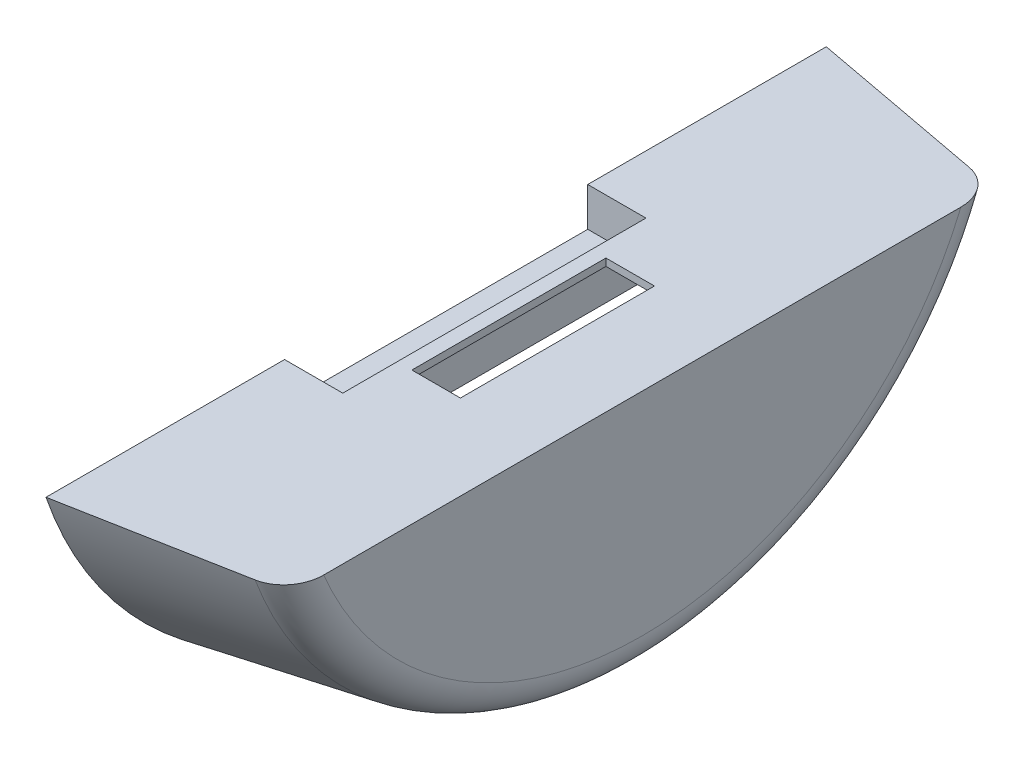
ISO-10303-21;
HEADER;
FILE_DESCRIPTION(('STEP AP214'),'2;1');
FILE_NAME('part.step','',(''),(''),'','','');
FILE_SCHEMA(('AUTOMOTIVE_DESIGN { 1 0 10303 214 1 1 1 1 }'));
ENDSEC;
DATA;
#1=APPLICATION_CONTEXT('core data for automotive mechanical design processes');
#2=APPLICATION_PROTOCOL_DEFINITION('international standard','automotive_design',2000,#1);
#3=PRODUCT_CONTEXT('',#1,'mechanical');
#4=PRODUCT('Part','Part','',(#3));
#5=PRODUCT_RELATED_PRODUCT_CATEGORY('part','',(#4));
#6=PRODUCT_DEFINITION_FORMATION('','',#4);
#7=PRODUCT_DEFINITION_CONTEXT('part definition',#1,'design');
#8=PRODUCT_DEFINITION('design','',#6,#7);
#9=PRODUCT_DEFINITION_SHAPE('','',#8);
#10=(LENGTH_UNIT() NAMED_UNIT(*) SI_UNIT(.MILLI.,.METRE.));
#11=(NAMED_UNIT(*) PLANE_ANGLE_UNIT() SI_UNIT($,.RADIAN.));
#12=(NAMED_UNIT(*) SI_UNIT($,.STERADIAN.) SOLID_ANGLE_UNIT());
#13=UNCERTAINTY_MEASURE_WITH_UNIT(LENGTH_MEASURE(1.E-05),#10,'distance_accuracy_value','');
#14=(GEOMETRIC_REPRESENTATION_CONTEXT(3) GLOBAL_UNCERTAINTY_ASSIGNED_CONTEXT((#13)) GLOBAL_UNIT_ASSIGNED_CONTEXT((#10,
#11,#12)) REPRESENTATION_CONTEXT('',''));
#15=CARTESIAN_POINT('',(0.,0.,0.));
#16=DIRECTION('',(0.,0.,1.));
#17=DIRECTION('',(1.,0.,0.));
#18=AXIS2_PLACEMENT_3D('',#15,#16,#17);
#19=CARTESIAN_POINT('',(85.,-55.,160.857079421454));
#20=DIRECTION('',(0.,-1.,0.));
#21=DIRECTION('',(0.,0.,-1.));
#22=AXIS2_PLACEMENT_3D('',#19,#20,#21);
#23=PLANE('',#22);
#24=DIRECTION('',(1.,0.,0.));
#25=VECTOR('',#24,1.);
#26=CARTESIAN_POINT('',(30.,-55.,40.));
#27=LINE('',#26,#25);
#28=CARTESIAN_POINT('',(30.,-55.,40.));
#29=VERTEX_POINT('',#28);
#30=CARTESIAN_POINT('',(50.,-55.,40.));
#31=VERTEX_POINT('',#30);
#32=EDGE_CURVE('E172',#29,#31,#27,.T.);
#33=ORIENTED_EDGE('',*,*,#32,.F.);
#34=DIRECTION('',(0.,0.,1.));
#35=VECTOR('',#34,1.);
#36=CARTESIAN_POINT('',(30.,-55.,-40.));
#37=LINE('',#36,#35);
#38=CARTESIAN_POINT('',(30.,-55.,-40.));
#39=VERTEX_POINT('',#38);
#40=EDGE_CURVE('E51',#39,#29,#37,.T.);
#41=ORIENTED_EDGE('',*,*,#40,.F.);
#42=DIRECTION('',(-1.,0.,0.));
#43=VECTOR('',#42,1.);
#44=CARTESIAN_POINT('',(30.,-55.,-40.));
#45=LINE('',#44,#43);
#46=CARTESIAN_POINT('',(50.,-55.,-40.));
#47=VERTEX_POINT('',#46);
#48=EDGE_CURVE('E178',#47,#39,#45,.T.);
#49=ORIENTED_EDGE('',*,*,#48,.F.);
#50=DIRECTION('',(0.,0.,-1.));
#51=VECTOR('',#50,1.);
#52=CARTESIAN_POINT('',(50.,-55.,-40.));
#53=LINE('',#52,#51);
#54=EDGE_CURVE('E163',#31,#47,#53,.T.);
#55=ORIENTED_EDGE('',*,*,#54,.F.);
#56=EDGE_LOOP('',(#33,#41,#49,#55));
#57=FACE_BOUND('',#56,.T.);
#58=DIRECTION('',(0.,0.,1.));
#59=VECTOR('',#58,1.);
#60=CARTESIAN_POINT('',(85.,-55.,160.857079421454));
#61=LINE('',#60,#59);
#62=CARTESIAN_POINT('',(85.,-55.,-131.366333308354));
#63=VERTEX_POINT('',#62);
#64=CARTESIAN_POINT('',(85.,-55.,131.366333308354));
#65=VERTEX_POINT('',#64);
#66=EDGE_CURVE('E301',#63,#65,#61,.T.);
#67=ORIENTED_EDGE('',*,*,#66,.F.);
#68=CARTESIAN_POINT('',(85.,-55.,-131.366333308354));
#69=CARTESIAN_POINT('',(85.0000217004886,-55.,-131.847998113283));
#70=CARTESIAN_POINT('',(84.9802595354916,-55.,-132.329657395687));
#71=CARTESIAN_POINT('',(84.9011367002977,-55.,-133.289800004888));
#72=CARTESIAN_POINT('',(84.8417685568107,-55.,-133.768282715082));
#73=CARTESIAN_POINT('',(84.6832129300085,-55.,-134.719863483213));
#74=CARTESIAN_POINT('',(84.583930224991,-55.,-135.19294586246));
#75=CARTESIAN_POINT('',(84.4053680370169,-55.,-135.894858542271));
#76=CARTESIAN_POINT('',(84.3409069757242,-55.,-136.127546144907));
#77=CARTESIAN_POINT('',(84.2021258271212,-55.,-136.590036884932));
#78=CARTESIAN_POINT('',(84.1278028946521,-55.,-136.81983916888));
#79=CARTESIAN_POINT('',(83.8899138443698,-55.,-137.50481973047));
#80=CARTESIAN_POINT('',(83.7115817841546,-55.,-137.954963685884));
#81=CARTESIAN_POINT('',(83.3163158102203,-55.,-138.837973459826));
#82=CARTESIAN_POINT('',(83.099384054965,-55.,-139.270840242824));
#83=CARTESIAN_POINT('',(82.7459672048439,-55.,-139.904131876115));
#84=CARTESIAN_POINT('',(82.6235365205562,-55.,-140.112495194183));
#85=CARTESIAN_POINT('',(82.3694952423523,-55.,-140.523470720562));
#86=CARTESIAN_POINT('',(82.237887022758,-55.,-140.726084397419));
#87=CARTESIAN_POINT('',(81.8294880486506,-55.,-141.324693126233));
#88=CARTESIAN_POINT('',(81.5390787653405,-55.,-141.711535235013));
#89=CARTESIAN_POINT('',(80.9387071454015,-55.,-142.438788278811));
#90=CARTESIAN_POINT('',(80.6303612108533,-55.,-142.780538325928));
#91=CARTESIAN_POINT('',(79.9843272088582,-55.,-143.435145956842));
#92=CARTESIAN_POINT('',(79.6466392545106,-55.,-143.748003651995));
#93=CARTESIAN_POINT('',(78.9443451986342,-55.,-144.341567587087));
#94=CARTESIAN_POINT('',(78.57975118395,-55.,-144.622288120944));
#95=CARTESIAN_POINT('',(77.8261656550564,-55.,-145.148788909642));
#96=CARTESIAN_POINT('',(77.437177114483,-55.,-145.39457341122));
#97=CARTESIAN_POINT('',(76.694161547378,-55.,-145.816535994463));
#98=CARTESIAN_POINT('',(76.3429239530571,-55.,-145.997642073186));
#99=CARTESIAN_POINT('',(75.6268790955325,-55.,-146.330540077362));
#100=CARTESIAN_POINT('',(75.2620740848824,-55.,-146.482336843261));
#101=CARTESIAN_POINT('',(74.5204893155726,-55.,-146.755560760924));
#102=CARTESIAN_POINT('',(74.1436899653607,-55.,-146.876935013921));
#103=CARTESIAN_POINT('',(73.5719149377617,-55.,-147.035132327188));
#104=CARTESIAN_POINT('',(73.3801725514498,-55.,-147.083897749144));
#105=CARTESIAN_POINT('',(72.9948111101114,-55.,-147.173364490282));
#106=CARTESIAN_POINT('',(72.801192012158,-55.,-147.214065624547));
#107=CARTESIAN_POINT('',(72.6067800086354,-55.,-147.250688194082));
#108=B_SPLINE_CURVE_WITH_KNOTS('',3,(#68,#69,#70,#71,#72,#73,#74,#75,#76,#77,#78,#79,#80,#81,
#82,#83,#84,#85,#86,#87,#88,#89,#90,#91,#92,#93,#94,#95,#96,#97,#98,#99,#100,#101,#102,#103,
#104,#105,#106,#107),.UNSPECIFIED.,.F.,.F.,(4,2,2,2,2,2,2,2,2,2,2,2,2,2,2,2,2,2,2,4),(0.,
1.44456767068413,2.88940799535424,4.33771583619181,5.0618815135296,5.78625656943377,
7.23688231549019,8.68742696921058,9.41222339522974,10.1368329997473,11.5857806690169,
12.9649117820621,14.3440375794608,15.7225475683278,17.1008898454341,18.2851531096823,
19.4692206247268,20.6553329363939,21.2487220953515,21.8421248593961),.UNSPECIFIED.);
#109=CARTESIAN_POINT('',(72.6067800086356,-55.,-147.250688194082));
#110=VERTEX_POINT('',#109);
#111=EDGE_CURVE('E343',#63,#110,#108,.T.);
#112=ORIENTED_EDGE('',*,*,#111,.T.);
#113=CARTESIAN_POINT('',(85.,-55.,-144.913767461894));
#114=CARTESIAN_POINT('',(77.9181877995605,-55.,-146.250475895791));
#115=CARTESIAN_POINT('',(70.8359537483595,-55.,-147.584948260698));
#116=CARTESIAN_POINT('',(56.6707071538972,-55.,-150.249743453704));
#117=CARTESIAN_POINT('',(49.5876946108658,-55.,-151.580066283027));
#118=CARTESIAN_POINT('',(35.4209523438063,-55.,-154.236885741812));
#119=CARTESIAN_POINT('',(28.3372226198058,-55.,-155.563382371422));
#120=CARTESIAN_POINT('',(14.1690970376694,-55.,-158.212825093285));
#121=CARTESIAN_POINT('',(7.08470117933804,-55.,-159.535771184491));
#122=CARTESIAN_POINT('',(-2.46823692712278E-12,-55.,-160.857079421454));
#123=B_SPLINE_CURVE_WITH_KNOTS('',3,(#113,#114,#115,#116,#117,#118,#119,#120,#121,#122),
.UNSPECIFIED.,.F.,.F.,(4,2,2,2,4),(0.,21.6205840064883,43.2411616446974,64.8617384480145,
86.4823216180021),.UNSPECIFIED.);
#124=CARTESIAN_POINT('',(0.,-55.,-160.857079421454));
#125=VERTEX_POINT('',#124);
#126=EDGE_CURVE('E318',#110,#125,#123,.T.);
#127=ORIENTED_EDGE('',*,*,#126,.T.);
#128=DIRECTION('',(0.,0.,1.));
#129=VECTOR('',#128,1.);
#130=CARTESIAN_POINT('',(0.,-55.,160.857079421454));
#131=LINE('',#130,#129);
#132=CARTESIAN_POINT('',(0.,-55.,-62.5));
#133=VERTEX_POINT('',#132);
#134=EDGE_CURVE('E305',#125,#133,#131,.T.);
#135=ORIENTED_EDGE('',*,*,#134,.T.);
#136=DIRECTION('',(-1.,0.,0.));
#137=VECTOR('',#136,1.);
#138=CARTESIAN_POINT('',(0.,-55.,-62.5));
#139=LINE('',#138,#137);
#140=CARTESIAN_POINT('',(24.,-55.,-62.5));
#141=VERTEX_POINT('',#140);
#142=EDGE_CURVE('E277',#141,#133,#139,.T.);
#143=ORIENTED_EDGE('',*,*,#142,.F.);
#144=DIRECTION('',(0.,0.,-1.));
#145=VECTOR('',#144,1.);
#146=CARTESIAN_POINT('',(24.,-55.,-62.5));
#147=LINE('',#146,#145);
#148=CARTESIAN_POINT('',(24.,-55.,62.5));
#149=VERTEX_POINT('',#148);
#150=EDGE_CURVE('E288',#149,#141,#147,.T.);
#151=ORIENTED_EDGE('',*,*,#150,.F.);
#152=DIRECTION('',(1.,0.,0.));
#153=VECTOR('',#152,1.);
#154=CARTESIAN_POINT('',(0.,-55.,62.5));
#155=LINE('',#154,#153);
#156=CARTESIAN_POINT('',(0.,-55.,62.5));
#157=VERTEX_POINT('',#156);
#158=EDGE_CURVE('E242',#157,#149,#155,.T.);
#159=ORIENTED_EDGE('',*,*,#158,.F.);
#160=CARTESIAN_POINT('',(0.,-55.,160.857079421454));
#161=VERTEX_POINT('',#160);
#162=EDGE_CURVE('E308',#157,#161,#131,.T.);
#163=ORIENTED_EDGE('',*,*,#162,.T.);
#164=CARTESIAN_POINT('',(-2.46635043204502E-12,-55.,160.857079421454));
#165=CARTESIAN_POINT('',(7.08470117933805,-55.,159.535771184491));
#166=CARTESIAN_POINT('',(14.1690970376694,-55.,158.212825093285));
#167=CARTESIAN_POINT('',(28.3372226198058,-55.,155.563382371422));
#168=CARTESIAN_POINT('',(35.4209523438063,-55.,154.236885741812));
#169=CARTESIAN_POINT('',(49.5876946108658,-55.,151.580066283027));
#170=CARTESIAN_POINT('',(56.6707071538972,-55.,150.249743453704));
#171=CARTESIAN_POINT('',(70.8359537483595,-55.,147.584948260698));
#172=CARTESIAN_POINT('',(77.9181877995605,-55.,146.250475895791));
#173=CARTESIAN_POINT('',(85.,-55.,144.913767461894));
#174=B_SPLINE_CURVE_WITH_KNOTS('',3,(#164,#165,#166,#167,#168,#169,#170,#171,#172,#173),
.UNSPECIFIED.,.F.,.F.,(4,2,2,2,4),(0.,21.6205831699876,43.2411599733046,64.8617376115138,
86.4823216180021),.UNSPECIFIED.);
#175=CARTESIAN_POINT('',(72.6067800086356,-55.,147.250688194082));
#176=VERTEX_POINT('',#175);
#177=EDGE_CURVE('E304',#161,#176,#174,.T.);
#178=ORIENTED_EDGE('',*,*,#177,.T.);
#179=CARTESIAN_POINT('',(72.6067800086357,-55.,147.250688194082));
#180=CARTESIAN_POINT('',(72.8084757428878,-55.,147.212693540349));
#181=CARTESIAN_POINT('',(73.0093168639264,-55.,147.170309174983));
#182=CARTESIAN_POINT('',(73.4089620994576,-55.,147.07686566863));
#183=CARTESIAN_POINT('',(73.6077662996728,-55.,147.025806894304));
#184=CARTESIAN_POINT('',(74.2004683692027,-55.,146.859823465695));
#185=CARTESIAN_POINT('',(74.5908491990172,-55.,146.732055170783));
#186=CARTESIAN_POINT('',(75.3580921684318,-55.,146.443961781262));
#187=CARTESIAN_POINT('',(75.7349889515207,-55.,146.283728412328));
#188=CARTESIAN_POINT('',(76.4739065579847,-55.,145.931967838129));
#189=CARTESIAN_POINT('',(76.835926819123,-55.,145.740439451474));
#190=CARTESIAN_POINT('',(77.5424792595213,-55.,145.327959200858));
#191=CARTESIAN_POINT('',(77.8870220567728,-55.,145.107025504335));
#192=CARTESIAN_POINT('',(78.5567613472811,-55.,144.637551570852));
#193=CARTESIAN_POINT('',(78.8819570371296,-55.,144.389010188683));
#194=CARTESIAN_POINT('',(79.5112085445602,-55.,143.866314432439));
#195=CARTESIAN_POINT('',(79.8152582482175,-55.,143.592152704028));
#196=CARTESIAN_POINT('',(80.400498011386,-55.,143.020440853485));
#197=CARTESIAN_POINT('',(80.6816875690996,-55.,142.722890218229));
#198=CARTESIAN_POINT('',(81.2296546045716,-55.,142.095373914813));
#199=CARTESIAN_POINT('',(81.4955308893981,-55.,141.764621345446));
#200=CARTESIAN_POINT('',(81.9999596491653,-55.,141.082909064762));
#201=CARTESIAN_POINT('',(82.2385114074563,-55.,140.731948823813));
#202=CARTESIAN_POINT('',(82.6873829850911,-55.,140.012152130531));
#203=CARTESIAN_POINT('',(82.897686656453,-55.,139.643305616105));
#204=CARTESIAN_POINT('',(83.2890880218411,-55.,138.890448800624));
#205=CARTESIAN_POINT('',(83.4701855673533,-55.,138.506438422472));
#206=CARTESIAN_POINT('',(83.8138339665425,-55.,137.699258197001));
#207=CARTESIAN_POINT('',(83.974295954884,-55.,137.275198249569));
#208=CARTESIAN_POINT('',(84.2606968808077,-55.,136.415569443841));
#209=CARTESIAN_POINT('',(84.3866339097594,-55.,135.979999950725));
#210=CARTESIAN_POINT('',(84.6035288752233,-55.,135.100758646193));
#211=CARTESIAN_POINT('',(84.6945244356241,-55.,134.6570960916));
#212=CARTESIAN_POINT('',(84.8415337777451,-55.,133.764182663562));
#213=CARTESIAN_POINT('',(84.8975632163205,-55.,133.314934383292));
#214=CARTESIAN_POINT('',(84.95744247887,-55.,132.61501204423));
#215=CARTESIAN_POINT('',(84.9734211629862,-55.,132.365315766274));
#216=CARTESIAN_POINT('',(84.994691095831,-55.,131.865864921181));
#217=CARTESIAN_POINT('',(84.9999992546784,-55.,131.616111074578));
#218=CARTESIAN_POINT('',(85.,-55.,131.366333308354));
#219=B_SPLINE_CURVE_WITH_KNOTS('',3,(#179,#180,#181,#182,#183,#184,#185,#186,#187,#188,#189,
#190,#191,#192,#193,#194,#195,#196,#197,#198,#199,#200,#201,#202,#203,#204,#205,#206,#207,#208,
#209,#210,#211,#212,#213,#214,#215,#216,#217,#218),.UNSPECIFIED.,.F.,.F.,(4,2,2,2,2,2,2,2,2,2,2,
2,2,2,2,2,2,2,2,4),(0.,0.615627223772209,1.23122843190879,2.46184212259638,3.68902618718072,
4.9162565888527,6.14273226208839,7.36925883046706,8.59613856192767,9.82304521706971,
11.0947528278651,12.3664937845381,13.6389586640896,14.9114300139533,16.2701431291207,
17.6289313423855,18.9862523242694,20.3429650987261,21.093383596197,21.8426119271803),.UNSPECIFIED.);
#220=EDGE_CURVE('E338',#176,#65,#219,.T.);
#221=ORIENTED_EDGE('',*,*,#220,.T.);
#222=EDGE_LOOP('',(#67,#112,#127,#135,#143,#151,#159,#163,#178,#221));
#223=FACE_BOUND('',#222,.T.);
#224=ADVANCED_FACE('F35',(#57,#223),#23,.F.);
#225=CARTESIAN_POINT('',(85.,0.,0.));
#226=DIRECTION('',(1.,0.,0.));
#227=DIRECTION('',(0.,0.,-1.));
#228=AXIS2_PLACEMENT_3D('',#225,#226,#227);
#229=PLANE('',#228);
#230=ORIENTED_EDGE('',*,*,#66,.T.);
#231=CARTESIAN_POINT('',(85.,0.,0.));
#232=DIRECTION('',(1.,0.,0.));
#233=DIRECTION('',(0.,0.,-1.));
#234=AXIS2_PLACEMENT_3D('',#231,#232,#233);
#235=CIRCLE('',#234,142.415285439736);
#236=EDGE_CURVE('E344',#65,#63,#235,.T.);
#237=ORIENTED_EDGE('',*,*,#236,.T.);
#238=EDGE_LOOP('',(#230,#237));
#239=FACE_BOUND('',#238,.T.);
#240=ADVANCED_FACE('F330',(#239),#229,.T.);
#241=CARTESIAN_POINT('',(0.,0.,0.));
#242=DIRECTION('',(1.,0.,0.));
#243=DIRECTION('',(0.,0.,-1.));
#244=AXIS2_PLACEMENT_3D('',#241,#242,#243);
#245=PLANE('',#244);
#246=DIRECTION('',(0.,1.,0.));
#247=VECTOR('',#246,1.);
#248=CARTESIAN_POINT('',(0.,0.,-65.5));
#249=LINE('',#248,#247);
#250=CARTESIAN_POINT('',(0.,-74.,-65.5));
#251=VERTEX_POINT('',#250);
#252=CARTESIAN_POINT('',(0.,-58.,-65.5));
#253=VERTEX_POINT('',#252);
#254=EDGE_CURVE('E249',#251,#253,#249,.T.);
#255=ORIENTED_EDGE('',*,*,#254,.F.);
#256=DIRECTION('',(0.,0.,1.));
#257=VECTOR('',#256,1.);
#258=CARTESIAN_POINT('',(0.,-74.,0.));
#259=LINE('',#258,#257);
#260=CARTESIAN_POINT('',(0.,-74.,65.5));
#261=VERTEX_POINT('',#260);
#262=EDGE_CURVE('E257',#251,#261,#259,.T.);
#263=ORIENTED_EDGE('',*,*,#262,.T.);
#264=DIRECTION('',(0.,1.,0.));
#265=VECTOR('',#264,1.);
#266=CARTESIAN_POINT('',(0.,-71.,65.5));
#267=LINE('',#266,#265);
#268=CARTESIAN_POINT('',(0.,-58.,65.5));
#269=VERTEX_POINT('',#268);
#270=EDGE_CURVE('E245',#261,#269,#267,.T.);
#271=ORIENTED_EDGE('',*,*,#270,.T.);
#272=DIRECTION('',(0.,0.,1.));
#273=VECTOR('',#272,1.);
#274=CARTESIAN_POINT('',(0.,-58.,160.857079421454));
#275=LINE('',#274,#273);
#276=CARTESIAN_POINT('',(0.,-58.,156.555164995341));
#277=VERTEX_POINT('',#276);
#278=EDGE_CURVE('E260',#269,#277,#275,.T.);
#279=ORIENTED_EDGE('',*,*,#278,.T.);
#280=CARTESIAN_POINT('',(0.,0.,0.));
#281=DIRECTION('',(1.,0.,0.));
#282=DIRECTION('',(0.,0.,-1.));
#283=AXIS2_PLACEMENT_3D('',#280,#281,#282);
#284=CIRCLE('',#283,166.953645323241);
#285=CARTESIAN_POINT('',(0.,-58.,-156.555164995341));
#286=VERTEX_POINT('',#285);
#287=EDGE_CURVE('E261',#277,#286,#284,.T.);
#288=ORIENTED_EDGE('',*,*,#287,.T.);
#289=DIRECTION('',(0.,0.,1.));
#290=VECTOR('',#289,1.);
#291=CARTESIAN_POINT('',(0.,-58.,160.857079421454));
#292=LINE('',#291,#290);
#293=EDGE_CURVE('E192',#286,#253,#292,.T.);
#294=ORIENTED_EDGE('',*,*,#293,.T.);
#295=EDGE_LOOP('',(#255,#263,#271,#279,#288,#294));
#296=FACE_BOUND('',#295,.T.);
#297=DIRECTION('',(0.,0.,1.));
#298=VECTOR('',#297,1.);
#299=CARTESIAN_POINT('',(0.,-71.,-62.5));
#300=LINE('',#299,#298);
#301=CARTESIAN_POINT('',(0.,-71.,-62.5));
#302=VERTEX_POINT('',#301);
#303=CARTESIAN_POINT('',(0.,-71.,62.5));
#304=VERTEX_POINT('',#303);
#305=EDGE_CURVE('E273',#302,#304,#300,.T.);
#306=ORIENTED_EDGE('',*,*,#305,.F.);
#307=DIRECTION('',(0.,1.,0.));
#308=VECTOR('',#307,1.);
#309=CARTESIAN_POINT('',(0.,-71.,-62.5));
#310=LINE('',#309,#308);
#311=EDGE_CURVE('E292',#302,#133,#310,.T.);
#312=ORIENTED_EDGE('',*,*,#311,.T.);
#313=ORIENTED_EDGE('',*,*,#134,.F.);
#314=CARTESIAN_POINT('',(0.,0.,0.));
#315=DIRECTION('',(1.,0.,0.));
#316=DIRECTION('',(0.,0.,-1.));
#317=AXIS2_PLACEMENT_3D('',#314,#315,#316);
#318=CIRCLE('',#317,170.);
#319=EDGE_CURVE('E295',#161,#125,#318,.T.);
#320=ORIENTED_EDGE('',*,*,#319,.F.);
#321=ORIENTED_EDGE('',*,*,#162,.F.);
#322=DIRECTION('',(0.,1.,0.));
#323=VECTOR('',#322,1.);
#324=CARTESIAN_POINT('',(0.,-71.,62.5));
#325=LINE('',#324,#323);
#326=EDGE_CURVE('E285',#304,#157,#325,.T.);
#327=ORIENTED_EDGE('',*,*,#326,.F.);
#328=EDGE_LOOP('',(#306,#312,#313,#320,#321,#327));
#329=FACE_BOUND('',#328,.T.);
#330=ADVANCED_FACE('F331',(#296,#329),#245,.F.);
#331=CARTESIAN_POINT('',(85.,0.,0.));
#332=DIRECTION('',(-1.,0.,0.));
#333=DIRECTION('',(0.,0.,1.));
#334=AXIS2_PLACEMENT_3D('',#331,#332,#333);
#335=CONICAL_SURFACE('',#334,155.,0.174672199008235);
#336=ORIENTED_EDGE('',*,*,#126,.F.);
#337=CARTESIAN_POINT('',(72.6067800086356,0.,0.));
#338=DIRECTION('',(1.,0.,0.));
#339=DIRECTION('',(0.,0.,-1.));
#340=AXIS2_PLACEMENT_3D('',#337,#338,#339);
#341=CIRCLE('',#340,157.187038822005);
#342=EDGE_CURVE('E350',#110,#176,#341,.F.);
#343=ORIENTED_EDGE('',*,*,#342,.T.);
#344=ORIENTED_EDGE('',*,*,#177,.F.);
#345=ORIENTED_EDGE('',*,*,#319,.T.);
#346=EDGE_LOOP('',(#336,#343,#344,#345));
#347=FACE_BOUND('',#346,.T.);
#348=ADVANCED_FACE('F325',(#347),#335,.T.);
#349=CARTESIAN_POINT('',(0.,-71.,-62.5));
#350=DIRECTION('',(0.,0.,-1.));
#351=DIRECTION('',(-1.,0.,0.));
#352=AXIS2_PLACEMENT_3D('',#349,#350,#351);
#353=PLANE('',#352);
#354=ORIENTED_EDGE('',*,*,#142,.T.);
#355=ORIENTED_EDGE('',*,*,#311,.F.);
#356=DIRECTION('',(-1.,0.,0.));
#357=VECTOR('',#356,1.);
#358=CARTESIAN_POINT('',(0.,-71.,-62.5));
#359=LINE('',#358,#357);
#360=CARTESIAN_POINT('',(24.,-71.,-62.5));
#361=VERTEX_POINT('',#360);
#362=EDGE_CURVE('E283',#361,#302,#359,.T.);
#363=ORIENTED_EDGE('',*,*,#362,.F.);
#364=DIRECTION('',(0.,1.,0.));
#365=VECTOR('',#364,1.);
#366=CARTESIAN_POINT('',(24.,-71.,-62.5));
#367=LINE('',#366,#365);
#368=EDGE_CURVE('E296',#361,#141,#367,.T.);
#369=ORIENTED_EDGE('',*,*,#368,.T.);
#370=EDGE_LOOP('',(#354,#355,#363,#369));
#371=FACE_BOUND('',#370,.T.);
#372=ADVANCED_FACE('F490',(#371),#353,.F.);
#373=CARTESIAN_POINT('',(24.,-71.,-62.5));
#374=DIRECTION('',(1.,0.,0.));
#375=DIRECTION('',(0.,0.,-1.));
#376=AXIS2_PLACEMENT_3D('',#373,#374,#375);
#377=PLANE('',#376);
#378=ORIENTED_EDGE('',*,*,#150,.T.);
#379=ORIENTED_EDGE('',*,*,#368,.F.);
#380=DIRECTION('',(0.,0.,-1.));
#381=VECTOR('',#380,1.);
#382=CARTESIAN_POINT('',(24.,-71.,-62.5));
#383=LINE('',#382,#381);
#384=CARTESIAN_POINT('',(24.,-71.,62.5));
#385=VERTEX_POINT('',#384);
#386=EDGE_CURVE('E280',#385,#361,#383,.T.);
#387=ORIENTED_EDGE('',*,*,#386,.F.);
#388=DIRECTION('',(0.,1.,0.));
#389=VECTOR('',#388,1.);
#390=CARTESIAN_POINT('',(24.,-71.,62.5));
#391=LINE('',#390,#389);
#392=EDGE_CURVE('E298',#385,#149,#391,.T.);
#393=ORIENTED_EDGE('',*,*,#392,.T.);
#394=EDGE_LOOP('',(#378,#379,#387,#393));
#395=FACE_BOUND('',#394,.T.);
#396=ADVANCED_FACE('F481',(#395),#377,.F.);
#397=CARTESIAN_POINT('',(0.,-71.,62.5));
#398=DIRECTION('',(0.,0.,1.));
#399=DIRECTION('',(1.,0.,0.));
#400=AXIS2_PLACEMENT_3D('',#397,#398,#399);
#401=PLANE('',#400);
#402=ORIENTED_EDGE('',*,*,#158,.T.);
#403=ORIENTED_EDGE('',*,*,#392,.F.);
#404=DIRECTION('',(1.,0.,0.));
#405=VECTOR('',#404,1.);
#406=CARTESIAN_POINT('',(0.,-71.,62.5));
#407=LINE('',#406,#405);
#408=EDGE_CURVE('E276',#304,#385,#407,.T.);
#409=ORIENTED_EDGE('',*,*,#408,.F.);
#410=ORIENTED_EDGE('',*,*,#326,.T.);
#411=EDGE_LOOP('',(#402,#403,#409,#410));
#412=FACE_BOUND('',#411,.T.);
#413=ADVANCED_FACE('F471',(#412),#401,.F.);
#414=CARTESIAN_POINT('',(0.,-71.,0.));
#415=DIRECTION('',(0.,1.,0.));
#416=DIRECTION('',(0.,0.,1.));
#417=AXIS2_PLACEMENT_3D('',#414,#415,#416);
#418=PLANE('',#417);
#419=ORIENTED_EDGE('',*,*,#305,.T.);
#420=ORIENTED_EDGE('',*,*,#408,.T.);
#421=ORIENTED_EDGE('',*,*,#386,.T.);
#422=ORIENTED_EDGE('',*,*,#362,.T.);
#423=EDGE_LOOP('',(#419,#420,#421,#422));
#424=FACE_BOUND('',#423,.T.);
#425=ADVANCED_FACE('F462',(#424),#418,.T.);
#426=CARTESIAN_POINT('',(70.,0.,0.));
#427=DIRECTION('',(1.,0.,0.));
#428=DIRECTION('',(0.,0.,-1.));
#429=AXIS2_PLACEMENT_3D('',#426,#427,#428);
#430=TOROIDAL_SURFACE('',#429,142.415285439736,15.);
#431=ORIENTED_EDGE('',*,*,#220,.F.);
#432=ORIENTED_EDGE('',*,*,#342,.F.);
#433=ORIENTED_EDGE('',*,*,#111,.F.);
#434=ORIENTED_EDGE('',*,*,#236,.F.);
#435=EDGE_LOOP('',(#431,#432,#433,#434));
#436=FACE_BOUND('',#435,.T.);
#437=ADVANCED_FACE('F37',(#436),#430,.T.);
#438=CARTESIAN_POINT('',(85.,-58.,160.857079421454));
#439=DIRECTION('',(0.,-1.,0.));
#440=DIRECTION('',(0.,0.,-1.));
#441=AXIS2_PLACEMENT_3D('',#438,#439,#440);
#442=PLANE('',#441);
#443=DIRECTION('',(0.,0.,-1.));
#444=VECTOR('',#443,1.);
#445=CARTESIAN_POINT('',(30.,-58.,160.857079421454));
#446=LINE('',#445,#444);
#447=CARTESIAN_POINT('',(30.,-58.,40.));
#448=VERTEX_POINT('',#447);
#449=CARTESIAN_POINT('',(30.,-58.,-40.));
#450=VERTEX_POINT('',#449);
#451=EDGE_CURVE('E11',#448,#450,#446,.T.);
#452=ORIENTED_EDGE('',*,*,#451,.F.);
#453=DIRECTION('',(-1.,0.,0.));
#454=VECTOR('',#453,1.);
#455=CARTESIAN_POINT('',(85.,-58.,40.));
#456=LINE('',#455,#454);
#457=CARTESIAN_POINT('',(50.,-58.,40.));
#458=VERTEX_POINT('',#457);
#459=EDGE_CURVE('E352',#458,#448,#456,.T.);
#460=ORIENTED_EDGE('',*,*,#459,.F.);
#461=DIRECTION('',(0.,0.,1.));
#462=VECTOR('',#461,1.);
#463=CARTESIAN_POINT('',(50.,-58.,160.857079421454));
#464=LINE('',#463,#462);
#465=CARTESIAN_POINT('',(50.,-58.,-40.));
#466=VERTEX_POINT('',#465);
#467=EDGE_CURVE('E166',#466,#458,#464,.T.);
#468=ORIENTED_EDGE('',*,*,#467,.F.);
#469=DIRECTION('',(1.,0.,0.));
#470=VECTOR('',#469,1.);
#471=CARTESIAN_POINT('',(85.,-58.,-40.));
#472=LINE('',#471,#470);
#473=EDGE_CURVE('E44',#450,#466,#472,.T.);
#474=ORIENTED_EDGE('',*,*,#473,.F.);
#475=EDGE_LOOP('',(#452,#460,#468,#474));
#476=FACE_BOUND('',#475,.T.);
#477=DIRECTION('',(0.,0.,1.));
#478=VECTOR('',#477,1.);
#479=CARTESIAN_POINT('',(82.,-58.,160.857079421454));
#480=LINE('',#479,#478);
#481=CARTESIAN_POINT('',(82.,-58.,-130.069648753587));
#482=VERTEX_POINT('',#481);
#483=CARTESIAN_POINT('',(82.,-58.,130.069648753587));
#484=VERTEX_POINT('',#483);
#485=EDGE_CURVE('E188',#482,#484,#480,.T.);
#486=ORIENTED_EDGE('',*,*,#485,.T.);
#487=CARTESIAN_POINT('',(72.0854240069084,-58.,142.91158837758));
#488=CARTESIAN_POINT('',(72.2461034110488,-58.,142.880987485106));
#489=CARTESIAN_POINT('',(72.4060903693426,-58.,142.846868533694));
#490=CARTESIAN_POINT('',(72.7244190142543,-58.,142.771683204182));
#491=CARTESIAN_POINT('',(72.8827607455175,-58.,142.73061701513));
#492=CARTESIAN_POINT('',(73.354774052952,-58.,142.5971749222));
#493=CARTESIAN_POINT('',(73.6656043222691,-58.,142.494522919624));
#494=CARTESIAN_POINT('',(74.2762828604684,-58.,142.263264006752));
#495=CARTESIAN_POINT('',(74.5761624227544,-58.,142.134739237736));
#496=CARTESIAN_POINT('',(75.163990002546,-58.,141.852775583933));
#497=CARTESIAN_POINT('',(75.4519374509505,-58.,141.699335512527));
#498=CARTESIAN_POINT('',(76.0137910991672,-58.,141.369125962237));
#499=CARTESIAN_POINT('',(76.2877087095988,-58.,141.192375873792));
#500=CARTESIAN_POINT('',(76.8201419784555,-58.,140.817014547885));
#501=CARTESIAN_POINT('',(77.0786566960043,-58.,140.618401977072));
#502=CARTESIAN_POINT('',(77.5789337548758,-58.,140.200925783584));
#503=CARTESIAN_POINT('',(77.8206896388155,-58.,139.982054429975));
#504=CARTESIAN_POINT('',(78.2861205151662,-58.,139.525874590414));
#505=CARTESIAN_POINT('',(78.5097950393669,-58.,139.288565627338));
#506=CARTESIAN_POINT('',(78.9471492696014,-58.,138.78683971257));
#507=CARTESIAN_POINT('',(79.1599985495505,-58.,138.521698920798));
#508=CARTESIAN_POINT('',(79.5640278584284,-58.,137.975280696217));
#509=CARTESIAN_POINT('',(79.7552008737889,-58.,137.693998084651));
#510=CARTESIAN_POINT('',(80.1151107538316,-58.,137.117291860821));
#511=CARTESIAN_POINT('',(80.2838391060503,-58.,136.821862940808));
#512=CARTESIAN_POINT('',(80.5981948392207,-58.,136.21895385221));
#513=CARTESIAN_POINT('',(80.743820637193,-58.,135.911472859621));
#514=CARTESIAN_POINT('',(81.0219646223929,-58.,135.262052864015));
#515=CARTESIAN_POINT('',(81.1525759212371,-58.,134.919296288148));
#516=CARTESIAN_POINT('',(81.3860195463758,-58.,134.224562166482));
#517=CARTESIAN_POINT('',(81.4888587050696,-58.,133.872586912045));
#518=CARTESIAN_POINT('',(81.66649709776,-58.,133.161961649622));
#519=CARTESIAN_POINT('',(81.7413197773652,-58.,132.803317487561));
#520=CARTESIAN_POINT('',(81.8629099819162,-58.,132.081439906355));
#521=CARTESIAN_POINT('',(81.9096896120822,-58.,131.718208536589));
#522=CARTESIAN_POINT('',(81.9616657344282,-58.,131.140143270744));
#523=CARTESIAN_POINT('',(81.9760591519448,-58.,130.926094497368));
#524=CARTESIAN_POINT('',(81.9952180889907,-58.,130.497919427653));
#525=CARTESIAN_POINT('',(81.9999994230594,-58.,130.283793839334));
#526=CARTESIAN_POINT('',(82.,-58.,130.069648753587));
#527=B_SPLINE_CURVE_WITH_KNOTS('',3,(#487,#488,#489,#490,#491,#492,#493,#494,#495,#496,#497,
#498,#499,#500,#501,#502,#503,#504,#505,#506,#507,#508,#509,#510,#511,#512,#513,#514,#515,#516,
#517,#518,#519,#520,#521,#522,#523,#524,#525,#526),.UNSPECIFIED.,.F.,.F.,(4,2,2,2,2,2,2,2,2,2,2,
2,2,2,2,2,2,2,2,4),(0.,0.490619524840906,0.981225701156537,1.96191885651386,2.93954624948224,
3.91722021676395,4.89408597615417,5.87101134574504,6.84831106805092,7.82563608908059,
8.8445524600791,9.8637975763241,10.8834281605573,11.9031285794027,13.0023231392977,
14.1012470325462,15.1992492243111,16.296777104346,16.9401787381079,17.5825209287974),.UNSPECIFIED.);
#528=CARTESIAN_POINT('',(72.0854240069084,-58.,142.91158837758));
#529=VERTEX_POINT('',#528);
#530=EDGE_CURVE('E202',#529,#484,#527,.T.);
#531=ORIENTED_EDGE('',*,*,#530,.F.);
#532=CARTESIAN_POINT('',(0.,-58.,156.555164995341));
#533=CARTESIAN_POINT('',(6.00829992239413,-58.,155.424448751444));
#534=CARTESIAN_POINT('',(12.0163323612745,-58.,154.292310601426));
#535=CARTESIAN_POINT('',(24.0318198493375,-58.,152.024984333529));
#536=CARTESIAN_POINT('',(30.0392748986904,-58.,150.889796216553));
#537=CARTESIAN_POINT('',(42.0535689433108,-58.,148.616163151883));
#538=CARTESIAN_POINT('',(48.0604079385575,-58.,147.47771820408));
#539=CARTESIAN_POINT('',(60.0734243637019,-58.,145.197333616956));
#540=CARTESIAN_POINT('',(66.0796017934032,-58.,144.055393976599));
#541=CARTESIAN_POINT('',(72.0854240069084,-58.,142.91158837758));
#542=B_SPLINE_CURVE_WITH_KNOTS('',3,(#532,#533,#534,#535,#536,#537,#538,#539,#540,#541),
.UNSPECIFIED.,.F.,.F.,(4,2,2,2,4),(0.,18.3413108571875,36.6826162851493,55.0239223273979,
73.3652337997801),.UNSPECIFIED.);
#543=EDGE_CURVE('E191',#277,#529,#542,.T.);
#544=ORIENTED_EDGE('',*,*,#543,.F.);
#545=ORIENTED_EDGE('',*,*,#278,.F.);
#546=DIRECTION('',(1.,0.,0.));
#547=VECTOR('',#546,1.);
#548=CARTESIAN_POINT('',(0.,-58.,65.5));
#549=LINE('',#548,#547);
#550=CARTESIAN_POINT('',(27.,-58.,65.5));
#551=VERTEX_POINT('',#550);
#552=EDGE_CURVE('E185',#269,#551,#549,.T.);
#553=ORIENTED_EDGE('',*,*,#552,.T.);
#554=DIRECTION('',(0.,0.,-1.));
#555=VECTOR('',#554,1.);
#556=CARTESIAN_POINT('',(27.,-58.,-62.5));
#557=LINE('',#556,#555);
#558=CARTESIAN_POINT('',(27.,-58.,-65.5));
#559=VERTEX_POINT('',#558);
#560=EDGE_CURVE('E574',#551,#559,#557,.T.);
#561=ORIENTED_EDGE('',*,*,#560,.T.);
#562=DIRECTION('',(-1.,0.,0.));
#563=VECTOR('',#562,1.);
#564=CARTESIAN_POINT('',(0.,-58.,-65.5));
#565=LINE('',#564,#563);
#566=EDGE_CURVE('E270',#559,#253,#565,.T.);
#567=ORIENTED_EDGE('',*,*,#566,.T.);
#568=ORIENTED_EDGE('',*,*,#293,.F.);
#569=CARTESIAN_POINT('',(72.0854240069084,-58.,-142.91158837758));
#570=CARTESIAN_POINT('',(66.0796017934031,-58.,-144.055393976599));
#571=CARTESIAN_POINT('',(60.0734243637019,-58.,-145.197333616956));
#572=CARTESIAN_POINT('',(48.0604079385575,-58.,-147.47771820408));
#573=CARTESIAN_POINT('',(42.0535689433108,-58.,-148.616163151883));
#574=CARTESIAN_POINT('',(30.0392748986904,-58.,-150.889796216553));
#575=CARTESIAN_POINT('',(24.0318198493375,-58.,-152.024984333529));
#576=CARTESIAN_POINT('',(12.0163323612745,-58.,-154.292310601426));
#577=CARTESIAN_POINT('',(6.00829992239414,-58.,-155.424448751444));
#578=CARTESIAN_POINT('',(0.,-58.,-156.555164995341));
#579=B_SPLINE_CURVE_WITH_KNOTS('',3,(#569,#570,#571,#572,#573,#574,#575,#576,#577,#578),
.UNSPECIFIED.,.F.,.F.,(4,2,2,2,4),(0.,18.3413114723822,36.6826175146308,55.0239229425926,
73.3652337997801),.UNSPECIFIED.);
#580=CARTESIAN_POINT('',(72.0854240069084,-58.,-142.91158837758));
#581=VERTEX_POINT('',#580);
#582=EDGE_CURVE('E203',#581,#286,#579,.T.);
#583=ORIENTED_EDGE('',*,*,#582,.F.);
#584=CARTESIAN_POINT('',(82.,-58.,-130.069648753587));
#585=CARTESIAN_POINT('',(82.0000190950265,-58.,-130.462372622982));
#586=CARTESIAN_POINT('',(81.983919013822,-58.,-130.855115827935));
#587=CARTESIAN_POINT('',(81.9194594347542,-58.,-131.638024096125));
#588=CARTESIAN_POINT('',(81.8710932989583,-58.,-132.028188612178));
#589=CARTESIAN_POINT('',(81.7419025161009,-58.,-132.804228121647));
#590=CARTESIAN_POINT('',(81.6609886661174,-58.,-133.190088306692));
#591=CARTESIAN_POINT('',(81.4668554446326,-58.,-133.953579378745));
#592=CARTESIAN_POINT('',(81.3536382841179,-58.,-134.33121082706));
#593=CARTESIAN_POINT('',(81.0949699767832,-58.,-135.07603181887));
#594=CARTESIAN_POINT('',(80.9494624585649,-58.,-135.443201818453));
#595=CARTESIAN_POINT('',(80.6268436867172,-58.,-136.163378861043));
#596=CARTESIAN_POINT('',(80.4497344439549,-58.,-136.516386803454));
#597=CARTESIAN_POINT('',(80.064863678515,-58.,-137.204801977604));
#598=CARTESIAN_POINT('',(79.8571353784129,-58.,-137.540227758359));
#599=CARTESIAN_POINT('',(79.4119290265177,-58.,-138.190721163671));
#600=CARTESIAN_POINT('',(79.1744532219109,-58.,-138.505790323285));
#601=CARTESIAN_POINT('',(78.6847642604907,-58.,-139.095960612591));
#602=CARTESIAN_POINT('',(78.4340459013414,-58.,-139.372302221498));
#603=CARTESIAN_POINT('',(77.908682647644,-58.,-139.901263670854));
#604=CARTESIAN_POINT('',(77.6340377328474,-58.,-140.153883491227));
#605=CARTESIAN_POINT('',(77.0628262909304,-58.,-140.63260007738));
#606=CARTESIAN_POINT('',(76.7662745002363,-58.,-140.858714412867));
#607=CARTESIAN_POINT('',(76.1532579662255,-58.,-141.282083886336));
#608=CARTESIAN_POINT('',(75.8367964868195,-58.,-141.479343737062));
#609=CARTESIAN_POINT('',(75.2453841367457,-58.,-141.809790324793));
#610=CARTESIAN_POINT('',(74.9732885683043,-58.,-141.94811175212));
#611=CARTESIAN_POINT('',(74.4190136221125,-58.,-142.202707123669));
#612=CARTESIAN_POINT('',(74.1368363082921,-58.,-142.318985550136));
#613=CARTESIAN_POINT('',(73.5635580661178,-58.,-142.528684593446));
#614=CARTESIAN_POINT('',(73.2724426662213,-58.,-142.62206567448));
#615=CARTESIAN_POINT('',(72.6834875809519,-58.,-142.784953078529));
#616=CARTESIAN_POINT('',(72.385645290087,-58.,-142.854449975542));
#617=CARTESIAN_POINT('',(72.0854240069084,-58.,-142.91158837758));
#618=B_SPLINE_CURVE_WITH_KNOTS('',3,(#584,#585,#586,#587,#588,#589,#590,#591,#592,#593,#594,
#595,#596,#597,#598,#599,#600,#601,#602,#603,#604,#605,#606,#607,#608,#609,#610,#611,#612,#613,
#614,#615,#616,#617),.UNSPECIFIED.,.F.,.F.,(4,2,2,2,2,2,2,2,2,2,2,2,2,2,2,2,4),(0.,
1.17787195569278,2.35598630379792,3.5373517301997,4.71863631792644,5.90199960600744,
7.08528762167256,8.26730105938425,9.44922525921001,10.5671354640005,11.6850466148628,
12.8022124939436,13.9191957043761,14.8339877084518,15.7485934979134,16.6647675478289,
17.5813027558441),.UNSPECIFIED.);
#619=EDGE_CURVE('E193',#482,#581,#618,.T.);
#620=ORIENTED_EDGE('',*,*,#619,.F.);
#621=EDGE_LOOP('',(#486,#531,#544,#545,#553,#561,#567,#568,#583,#620));
#622=FACE_BOUND('',#621,.T.);
#623=ADVANCED_FACE('F213',(#476,#622),#442,.T.);
#624=CARTESIAN_POINT('',(82.,0.,0.));
#625=DIRECTION('',(1.,0.,0.));
#626=DIRECTION('',(0.,0.,-1.));
#627=AXIS2_PLACEMENT_3D('',#624,#625,#626);
#628=PLANE('',#627);
#629=ORIENTED_EDGE('',*,*,#485,.F.);
#630=CARTESIAN_POINT('',(82.,0.,0.));
#631=DIRECTION('',(1.,0.,0.));
#632=DIRECTION('',(0.,0.,-1.));
#633=AXIS2_PLACEMENT_3D('',#630,#631,#632);
#634=CIRCLE('',#633,142.415285439736);
#635=EDGE_CURVE('E238',#484,#482,#634,.T.);
#636=ORIENTED_EDGE('',*,*,#635,.F.);
#637=EDGE_LOOP('',(#629,#636));
#638=FACE_BOUND('',#637,.T.);
#639=ADVANCED_FACE('F216',(#638),#628,.F.);
#640=CARTESIAN_POINT('',(84.4786439982729,0.,0.));
#641=DIRECTION('',(-1.,0.,0.));
#642=DIRECTION('',(0.,0.,1.));
#643=AXIS2_PLACEMENT_3D('',#640,#641,#642);
#644=CONICAL_SURFACE('',#643,152.045649323546,0.174672199008235);
#645=ORIENTED_EDGE('',*,*,#582,.T.);
#646=ORIENTED_EDGE('',*,*,#287,.F.);
#647=ORIENTED_EDGE('',*,*,#543,.T.);
#648=CARTESIAN_POINT('',(72.0854240069084,0.,0.));
#649=DIRECTION('',(-1.,0.,0.));
#650=DIRECTION('',(0.,0.,1.));
#651=AXIS2_PLACEMENT_3D('',#648,#649,#650);
#652=CIRCLE('',#651,154.232688145552);
#653=EDGE_CURVE('E201',#581,#529,#652,.T.);
#654=ORIENTED_EDGE('',*,*,#653,.F.);
#655=EDGE_LOOP('',(#645,#646,#647,#654));
#656=FACE_BOUND('',#655,.T.);
#657=ADVANCED_FACE('F218',(#656),#644,.F.);
#658=CARTESIAN_POINT('',(0.,-71.,-65.5));
#659=DIRECTION('',(0.,0.,-1.));
#660=DIRECTION('',(-1.,0.,0.));
#661=AXIS2_PLACEMENT_3D('',#658,#659,#660);
#662=PLANE('',#661);
#663=ORIENTED_EDGE('',*,*,#566,.F.);
#664=DIRECTION('',(0.,1.,0.));
#665=VECTOR('',#664,1.);
#666=CARTESIAN_POINT('',(27.,-71.,-65.5));
#667=LINE('',#666,#665);
#668=CARTESIAN_POINT('',(27.,-74.,-65.5));
#669=VERTEX_POINT('',#668);
#670=EDGE_CURVE('E247',#669,#559,#667,.T.);
#671=ORIENTED_EDGE('',*,*,#670,.F.);
#672=DIRECTION('',(-1.,0.,0.));
#673=VECTOR('',#672,1.);
#674=CARTESIAN_POINT('',(0.,-74.,-65.5));
#675=LINE('',#674,#673);
#676=EDGE_CURVE('E243',#669,#251,#675,.T.);
#677=ORIENTED_EDGE('',*,*,#676,.T.);
#678=ORIENTED_EDGE('',*,*,#254,.T.);
#679=EDGE_LOOP('',(#663,#671,#677,#678));
#680=FACE_BOUND('',#679,.T.);
#681=ADVANCED_FACE('F426',(#680),#662,.T.);
#682=CARTESIAN_POINT('',(27.,-71.,-62.5));
#683=DIRECTION('',(1.,0.,0.));
#684=DIRECTION('',(0.,0.,-1.));
#685=AXIS2_PLACEMENT_3D('',#682,#683,#684);
#686=PLANE('',#685);
#687=ORIENTED_EDGE('',*,*,#560,.F.);
#688=DIRECTION('',(0.,1.,0.));
#689=VECTOR('',#688,1.);
#690=CARTESIAN_POINT('',(27.,-71.,65.5));
#691=LINE('',#690,#689);
#692=CARTESIAN_POINT('',(27.,-74.,65.5));
#693=VERTEX_POINT('',#692);
#694=EDGE_CURVE('E250',#693,#551,#691,.T.);
#695=ORIENTED_EDGE('',*,*,#694,.F.);
#696=DIRECTION('',(0.,0.,-1.));
#697=VECTOR('',#696,1.);
#698=CARTESIAN_POINT('',(27.,-74.,0.));
#699=LINE('',#698,#697);
#700=EDGE_CURVE('E246',#693,#669,#699,.T.);
#701=ORIENTED_EDGE('',*,*,#700,.T.);
#702=ORIENTED_EDGE('',*,*,#670,.T.);
#703=EDGE_LOOP('',(#687,#695,#701,#702));
#704=FACE_BOUND('',#703,.T.);
#705=ADVANCED_FACE('F417',(#704),#686,.T.);
#706=CARTESIAN_POINT('',(0.,-71.,65.5));
#707=DIRECTION('',(0.,0.,1.));
#708=DIRECTION('',(1.,0.,0.));
#709=AXIS2_PLACEMENT_3D('',#706,#707,#708);
#710=PLANE('',#709);
#711=ORIENTED_EDGE('',*,*,#552,.F.);
#712=ORIENTED_EDGE('',*,*,#270,.F.);
#713=DIRECTION('',(1.,0.,0.));
#714=VECTOR('',#713,1.);
#715=CARTESIAN_POINT('',(0.,-74.,65.5));
#716=LINE('',#715,#714);
#717=EDGE_CURVE('E253',#261,#693,#716,.T.);
#718=ORIENTED_EDGE('',*,*,#717,.T.);
#719=ORIENTED_EDGE('',*,*,#694,.T.);
#720=EDGE_LOOP('',(#711,#712,#718,#719));
#721=FACE_BOUND('',#720,.T.);
#722=ADVANCED_FACE('F408',(#721),#710,.T.);
#723=CARTESIAN_POINT('',(0.,-74.,0.));
#724=DIRECTION('',(0.,1.,0.));
#725=DIRECTION('',(0.,0.,1.));
#726=AXIS2_PLACEMENT_3D('',#723,#724,#725);
#727=PLANE('',#726);
#728=ORIENTED_EDGE('',*,*,#262,.F.);
#729=ORIENTED_EDGE('',*,*,#676,.F.);
#730=ORIENTED_EDGE('',*,*,#700,.F.);
#731=ORIENTED_EDGE('',*,*,#717,.F.);
#732=EDGE_LOOP('',(#728,#729,#730,#731));
#733=FACE_BOUND('',#732,.T.);
#734=ADVANCED_FACE('F367',(#733),#727,.F.);
#735=CARTESIAN_POINT('',(70.,0.,0.));
#736=DIRECTION('',(1.,0.,0.));
#737=DIRECTION('',(0.,0.,-1.));
#738=AXIS2_PLACEMENT_3D('',#735,#736,#737);
#739=TOROIDAL_SURFACE('',#738,142.415285439736,12.);
#740=ORIENTED_EDGE('',*,*,#530,.T.);
#741=ORIENTED_EDGE('',*,*,#635,.T.);
#742=ORIENTED_EDGE('',*,*,#619,.T.);
#743=ORIENTED_EDGE('',*,*,#653,.T.);
#744=EDGE_LOOP('',(#740,#741,#742,#743));
#745=FACE_BOUND('',#744,.T.);
#746=ADVANCED_FACE('F210',(#745),#739,.F.);
#747=CARTESIAN_POINT('',(30.,-65.,-40.));
#748=DIRECTION('',(-1.,0.,0.));
#749=DIRECTION('',(0.,0.,1.));
#750=AXIS2_PLACEMENT_3D('',#747,#748,#749);
#751=PLANE('',#750);
#752=ORIENTED_EDGE('',*,*,#451,.T.);
#753=DIRECTION('',(0.,1.,0.));
#754=VECTOR('',#753,1.);
#755=CARTESIAN_POINT('',(30.,-65.,-40.));
#756=LINE('',#755,#754);
#757=EDGE_CURVE('E183',#450,#39,#756,.T.);
#758=ORIENTED_EDGE('',*,*,#757,.T.);
#759=ORIENTED_EDGE('',*,*,#40,.T.);
#760=DIRECTION('',(0.,1.,0.));
#761=VECTOR('',#760,1.);
#762=CARTESIAN_POINT('',(30.,-65.,40.));
#763=LINE('',#762,#761);
#764=EDGE_CURVE('E169',#448,#29,#763,.T.);
#765=ORIENTED_EDGE('',*,*,#764,.F.);
#766=EDGE_LOOP('',(#752,#758,#759,#765));
#767=FACE_BOUND('',#766,.T.);
#768=ADVANCED_FACE('F360',(#767),#751,.F.);
#769=CARTESIAN_POINT('',(30.,-65.,-40.));
#770=DIRECTION('',(0.,0.,-1.));
#771=DIRECTION('',(-1.,0.,0.));
#772=AXIS2_PLACEMENT_3D('',#769,#770,#771);
#773=PLANE('',#772);
#774=ORIENTED_EDGE('',*,*,#473,.T.);
#775=DIRECTION('',(0.,1.,0.));
#776=VECTOR('',#775,1.);
#777=CARTESIAN_POINT('',(50.,-65.,-40.));
#778=LINE('',#777,#776);
#779=EDGE_CURVE('E168',#466,#47,#778,.T.);
#780=ORIENTED_EDGE('',*,*,#779,.T.);
#781=ORIENTED_EDGE('',*,*,#48,.T.);
#782=ORIENTED_EDGE('',*,*,#757,.F.);
#783=EDGE_LOOP('',(#774,#780,#781,#782));
#784=FACE_BOUND('',#783,.T.);
#785=ADVANCED_FACE('F357',(#784),#773,.F.);
#786=CARTESIAN_POINT('',(50.,-65.,-40.));
#787=DIRECTION('',(1.,0.,0.));
#788=DIRECTION('',(0.,0.,-1.));
#789=AXIS2_PLACEMENT_3D('',#786,#787,#788);
#790=PLANE('',#789);
#791=ORIENTED_EDGE('',*,*,#467,.T.);
#792=DIRECTION('',(0.,1.,0.));
#793=VECTOR('',#792,1.);
#794=CARTESIAN_POINT('',(50.,-65.,40.));
#795=LINE('',#794,#793);
#796=EDGE_CURVE('E59',#458,#31,#795,.T.);
#797=ORIENTED_EDGE('',*,*,#796,.T.);
#798=ORIENTED_EDGE('',*,*,#54,.T.);
#799=ORIENTED_EDGE('',*,*,#779,.F.);
#800=EDGE_LOOP('',(#791,#797,#798,#799));
#801=FACE_BOUND('',#800,.T.);
#802=ADVANCED_FACE('F160',(#801),#790,.F.);
#803=CARTESIAN_POINT('',(30.,-65.,40.));
#804=DIRECTION('',(0.,0.,1.));
#805=DIRECTION('',(1.,0.,0.));
#806=AXIS2_PLACEMENT_3D('',#803,#804,#805);
#807=PLANE('',#806);
#808=ORIENTED_EDGE('',*,*,#459,.T.);
#809=ORIENTED_EDGE('',*,*,#764,.T.);
#810=ORIENTED_EDGE('',*,*,#32,.T.);
#811=ORIENTED_EDGE('',*,*,#796,.F.);
#812=EDGE_LOOP('',(#808,#809,#810,#811));
#813=FACE_BOUND('',#812,.T.);
#814=ADVANCED_FACE('F173',(#813),#807,.F.);
#815=CLOSED_SHELL('',(#224,#240,#330,#348,#372,#396,#413,#425,#437,#623,#639,#657,#681,#705,
#722,#734,#746,#768,#785,#802,#814));
#816=MANIFOLD_SOLID_BREP('B2',#815);
#817=ADVANCED_BREP_SHAPE_REPRESENTATION('',(#18,#816),#14);
#818=SHAPE_DEFINITION_REPRESENTATION(#9,#817);
ENDSEC;
END-ISO-10303-21;
